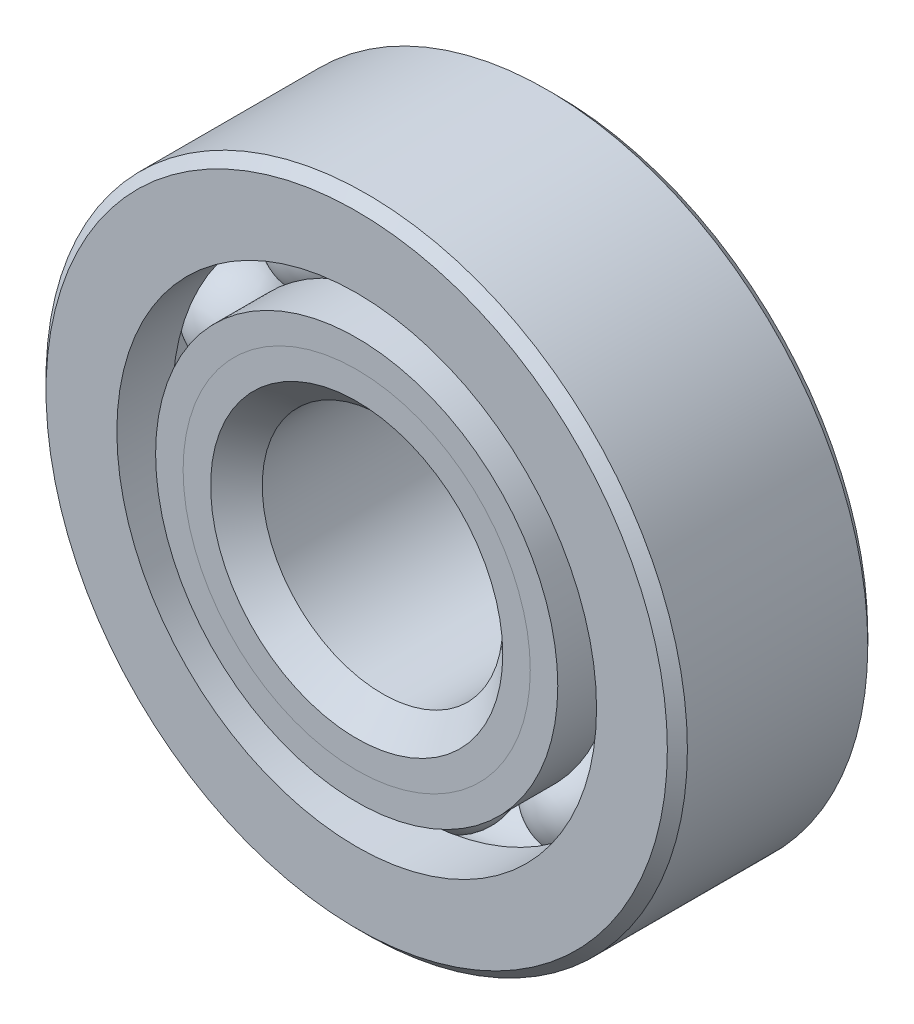
ISO-10303-21;
HEADER;
FILE_DESCRIPTION(('STEP AP214'),'2;1');
FILE_NAME('part.step','',(''),(''),'','','');
FILE_SCHEMA(('AUTOMOTIVE_DESIGN { 1 0 10303 214 1 1 1 1 }'));
ENDSEC;
DATA;
#1=APPLICATION_CONTEXT('core data for automotive mechanical design processes');
#2=APPLICATION_PROTOCOL_DEFINITION('international standard','automotive_design',2000,#1);
#3=PRODUCT_CONTEXT('',#1,'mechanical');
#4=PRODUCT('Part','Part','',(#3));
#5=PRODUCT_RELATED_PRODUCT_CATEGORY('part','',(#4));
#6=PRODUCT_DEFINITION_FORMATION('','',#4);
#7=PRODUCT_DEFINITION_CONTEXT('part definition',#1,'design');
#8=PRODUCT_DEFINITION('design','',#6,#7);
#9=PRODUCT_DEFINITION_SHAPE('','',#8);
#10=(LENGTH_UNIT() NAMED_UNIT(*) SI_UNIT(.MILLI.,.METRE.));
#11=(NAMED_UNIT(*) PLANE_ANGLE_UNIT() SI_UNIT($,.RADIAN.));
#12=(NAMED_UNIT(*) SI_UNIT($,.STERADIAN.) SOLID_ANGLE_UNIT());
#13=UNCERTAINTY_MEASURE_WITH_UNIT(LENGTH_MEASURE(1.E-05),#10,'distance_accuracy_value','');
#14=(GEOMETRIC_REPRESENTATION_CONTEXT(3) GLOBAL_UNCERTAINTY_ASSIGNED_CONTEXT((#13)) GLOBAL_UNIT_ASSIGNED_CONTEXT((#10,
#11,#12)) REPRESENTATION_CONTEXT('',''));
#15=CARTESIAN_POINT('',(0.,0.,0.));
#16=DIRECTION('',(0.,0.,1.));
#17=DIRECTION('',(1.,0.,0.));
#18=AXIS2_PLACEMENT_3D('',#15,#16,#17);
#19=CARTESIAN_POINT('',(-2.56604999203928,3.53186481606816,0.));
#20=DIRECTION('',(0.,0.,1.));
#21=DIRECTION('',(-0.587785252292462,0.809016994374955,0.));
#22=AXIS2_PLACEMENT_3D('',#19,#20,#21);
#23=SPHERICAL_SURFACE('',#22,0.961832467237323);
#24=CARTESIAN_POINT('',(-2.56604999203928,3.53186481606816,0.961832467237322));
#25=VERTEX_POINT('',#24);
#26=VERTEX_LOOP('',#25);
#27=FACE_BOUND('',#26,.T.);
#28=ADVANCED_FACE('F39',(#27),#23,.T.);
#29=CLOSED_SHELL('',(#28));
#30=MANIFOLD_SOLID_BREP('B2',#29);
#31=CARTESIAN_POINT('',(-4.15195610395101,1.34905231606818,0.));
#32=DIRECTION('',(0.,0.,1.));
#33=DIRECTION('',(-0.95105651629515,0.309016994374958,0.));
#34=AXIS2_PLACEMENT_3D('',#31,#32,#33);
#35=SPHERICAL_SURFACE('',#34,0.961832467237323);
#36=CARTESIAN_POINT('',(-4.15195610395101,1.34905231606818,0.961832467237322));
#37=VERTEX_POINT('',#36);
#38=VERTEX_LOOP('',#37);
#39=FACE_BOUND('',#38,.T.);
#40=ADVANCED_FACE('F71',(#39),#35,.T.);
#41=CLOSED_SHELL('',(#40));
#42=MANIFOLD_SOLID_BREP('B6',#41);
#43=CARTESIAN_POINT('',(-4.15195610395104,-1.34905231606809,0.));
#44=DIRECTION('',(0.,0.,1.));
#45=DIRECTION('',(-0.951056516295157,-0.309016994374938,0.));
#46=AXIS2_PLACEMENT_3D('',#43,#44,#45);
#47=SPHERICAL_SURFACE('',#46,0.961832467237323);
#48=CARTESIAN_POINT('',(-4.15195610395104,-1.34905231606809,0.961832467237322));
#49=VERTEX_POINT('',#48);
#50=VERTEX_LOOP('',#49);
#51=FACE_BOUND('',#50,.T.);
#52=ADVANCED_FACE('F103',(#51),#47,.T.);
#53=CLOSED_SHELL('',(#52));
#54=MANIFOLD_SOLID_BREP('B35',#53);
#55=CARTESIAN_POINT('',(-2.56604999203936,-3.53186481606811,0.));
#56=DIRECTION('',(0.,0.,1.));
#57=DIRECTION('',(-0.58778525229248,-0.809016994374942,0.));
#58=AXIS2_PLACEMENT_3D('',#55,#56,#57);
#59=SPHERICAL_SURFACE('',#58,0.961832467237323);
#60=CARTESIAN_POINT('',(-2.56604999203936,-3.53186481606811,0.961832467237322));
#61=VERTEX_POINT('',#60);
#62=VERTEX_LOOP('',#61);
#63=FACE_BOUND('',#62,.T.);
#64=ADVANCED_FACE('F135',(#63),#59,.T.);
#65=CLOSED_SHELL('',(#64));
#66=MANIFOLD_SOLID_BREP('B67',#65);
#67=CARTESIAN_POINT('',(0.,-4.365625,0.));
#68=DIRECTION('',(0.,0.,1.));
#69=DIRECTION('',(0.,-1.,0.));
#70=AXIS2_PLACEMENT_3D('',#67,#68,#69);
#71=SPHERICAL_SURFACE('',#70,0.961832467237323);
#72=CARTESIAN_POINT('',(0.,-4.365625,0.961832467237322));
#73=VERTEX_POINT('',#72);
#74=VERTEX_LOOP('',#73);
#75=FACE_BOUND('',#74,.T.);
#76=ADVANCED_FACE('F167',(#75),#71,.T.);
#77=CLOSED_SHELL('',(#76));
#78=MANIFOLD_SOLID_BREP('B99',#77);
#79=CARTESIAN_POINT('',(2.56604999203931,-3.53186481606814,0.));
#80=DIRECTION('',(0.,0.,1.));
#81=DIRECTION('',(0.587785252292469,-0.809016994374951,0.));
#82=AXIS2_PLACEMENT_3D('',#79,#80,#81);
#83=SPHERICAL_SURFACE('',#82,0.961832467237323);
#84=CARTESIAN_POINT('',(2.56604999203931,-3.53186481606814,0.961832467237322));
#85=VERTEX_POINT('',#84);
#86=VERTEX_LOOP('',#85);
#87=FACE_BOUND('',#86,.T.);
#88=ADVANCED_FACE('F199',(#87),#83,.T.);
#89=CLOSED_SHELL('',(#88));
#90=MANIFOLD_SOLID_BREP('B131',#89);
#91=CARTESIAN_POINT('',(4.15195610395102,-1.34905231606815,0.));
#92=DIRECTION('',(0.,0.,1.));
#93=DIRECTION('',(0.951056516295152,-0.309016994374952,0.));
#94=AXIS2_PLACEMENT_3D('',#91,#92,#93);
#95=SPHERICAL_SURFACE('',#94,0.961832467237323);
#96=CARTESIAN_POINT('',(4.15195610395102,-1.34905231606815,0.961832467237322));
#97=VERTEX_POINT('',#96);
#98=VERTEX_LOOP('',#97);
#99=FACE_BOUND('',#98,.T.);
#100=ADVANCED_FACE('F231',(#99),#95,.T.);
#101=CLOSED_SHELL('',(#100));
#102=MANIFOLD_SOLID_BREP('B163',#101);
#103=CARTESIAN_POINT('',(4.15195610395103,1.34905231606812,0.));
#104=DIRECTION('',(0.,0.,1.));
#105=DIRECTION('',(0.951056516295155,0.309016994374945,0.));
#106=AXIS2_PLACEMENT_3D('',#103,#104,#105);
#107=SPHERICAL_SURFACE('',#106,0.961832467237323);
#108=CARTESIAN_POINT('',(4.15195610395103,1.34905231606812,0.961832467237322));
#109=VERTEX_POINT('',#108);
#110=VERTEX_LOOP('',#109);
#111=FACE_BOUND('',#110,.T.);
#112=ADVANCED_FACE('F263',(#111),#107,.T.);
#113=CLOSED_SHELL('',(#112));
#114=MANIFOLD_SOLID_BREP('B195',#113);
#115=CARTESIAN_POINT('',(2.56604999203933,3.53186481606813,0.));
#116=DIRECTION('',(0.,0.,1.));
#117=DIRECTION('',(0.587785252292474,0.809016994374947,0.));
#118=AXIS2_PLACEMENT_3D('',#115,#116,#117);
#119=SPHERICAL_SURFACE('',#118,0.961832467237323);
#120=CARTESIAN_POINT('',(2.56604999203933,3.53186481606813,0.961832467237322));
#121=VERTEX_POINT('',#120);
#122=VERTEX_LOOP('',#121);
#123=FACE_BOUND('',#122,.T.);
#124=ADVANCED_FACE('F295',(#123),#119,.T.);
#125=CLOSED_SHELL('',(#124));
#126=MANIFOLD_SOLID_BREP('B227',#125);
#127=CARTESIAN_POINT('',(0.,4.365625,0.));
#128=DIRECTION('',(0.,0.,1.));
#129=DIRECTION('',(0.,1.,0.));
#130=AXIS2_PLACEMENT_3D('',#127,#128,#129);
#131=SPHERICAL_SURFACE('',#130,0.961832467237323);
#132=CARTESIAN_POINT('',(0.,4.365625,0.961832467237322));
#133=VERTEX_POINT('',#132);
#134=VERTEX_LOOP('',#133);
#135=FACE_BOUND('',#134,.T.);
#136=ADVANCED_FACE('F329',(#135),#131,.T.);
#137=CLOSED_SHELL('',(#136));
#138=MANIFOLD_SOLID_BREP('B259',#137);
#139=CARTESIAN_POINT('',(0.,3.43717752879507,1.984375));
#140=DIRECTION('',(0.,0.,-1.));
#141=DIRECTION('',(-1.,0.,0.));
#142=AXIS2_PLACEMENT_3D('',#139,#140,#141);
#143=PLANE('',#142);
#144=CARTESIAN_POINT('',(0.,0.,1.984375));
#145=DIRECTION('',(0.,0.,1.));
#146=DIRECTION('',(1.,0.,0.));
#147=AXIS2_PLACEMENT_3D('',#144,#145,#146);
#148=CIRCLE('',#147,2.89252126638134);
#149=CARTESIAN_POINT('',(2.89252126638134,0.,1.984375));
#150=VERTEX_POINT('',#149);
#151=EDGE_CURVE('E383',#150,#150,#148,.T.);
#152=ORIENTED_EDGE('',*,*,#151,.F.);
#153=EDGE_LOOP('',(#152));
#154=FACE_BOUND('',#153,.T.);
#155=CARTESIAN_POINT('',(0.,0.,1.984375));
#156=DIRECTION('',(0.,0.,1.));
#157=DIRECTION('',(1.,0.,0.));
#158=AXIS2_PLACEMENT_3D('',#155,#156,#157);
#159=CIRCLE('',#158,3.43717752879507);
#160=CARTESIAN_POINT('',(3.43717752879507,0.,1.984375));
#161=VERTEX_POINT('',#160);
#162=EDGE_CURVE('E328',#161,#161,#159,.T.);
#163=ORIENTED_EDGE('',*,*,#162,.T.);
#164=EDGE_LOOP('',(#163));
#165=FACE_BOUND('',#164,.T.);
#166=ADVANCED_FACE('F349',(#154,#165),#143,.F.);
#167=CARTESIAN_POINT('',(0.,0.,1.43971873758628));
#168=DIRECTION('',(0.,0.,1.));
#169=DIRECTION('',(1.,0.,0.));
#170=AXIS2_PLACEMENT_3D('',#167,#168,#169);
#171=CONICAL_SURFACE('',#170,2.89252126638134,0.78539816339745);
#172=ORIENTED_EDGE('',*,*,#162,.F.);
#173=EDGE_LOOP('',(#172));
#174=FACE_BOUND('',#173,.T.);
#175=CARTESIAN_POINT('',(0.,0.,1.43971873758628));
#176=DIRECTION('',(0.,0.,1.));
#177=DIRECTION('',(1.,0.,0.));
#178=AXIS2_PLACEMENT_3D('',#175,#176,#177);
#179=CIRCLE('',#178,2.89252126638134);
#180=CARTESIAN_POINT('',(2.89252126638134,0.,1.43971873758628));
#181=VERTEX_POINT('',#180);
#182=EDGE_CURVE('E355',#181,#181,#179,.T.);
#183=ORIENTED_EDGE('',*,*,#182,.T.);
#184=EDGE_LOOP('',(#183));
#185=FACE_BOUND('',#184,.T.);
#186=ADVANCED_FACE('F390',(#174,#185),#171,.T.);
#187=CARTESIAN_POINT('',(0.,0.,1.984375));
#188=DIRECTION('',(0.,0.,1.));
#189=DIRECTION('',(1.,0.,0.));
#190=AXIS2_PLACEMENT_3D('',#187,#188,#189);
#191=CYLINDRICAL_SURFACE('',#190,2.89252126638134);
#192=ORIENTED_EDGE('',*,*,#182,.F.);
#193=EDGE_LOOP('',(#192));
#194=FACE_BOUND('',#193,.T.);
#195=CARTESIAN_POINT('',(0.,0.,0.));
#196=DIRECTION('',(0.,0.,1.));
#197=DIRECTION('',(1.,0.,0.));
#198=AXIS2_PLACEMENT_3D('',#195,#196,#197);
#199=CIRCLE('',#198,2.89252126638134);
#200=CARTESIAN_POINT('',(2.89252126638134,0.,0.));
#201=VERTEX_POINT('',#200);
#202=EDGE_CURVE('E359',#201,#201,#199,.T.);
#203=ORIENTED_EDGE('',*,*,#202,.T.);
#204=EDGE_LOOP('',(#203));
#205=FACE_BOUND('',#204,.T.);
#206=ADVANCED_FACE('F394',(#194,#205),#191,.T.);
#207=CARTESIAN_POINT('',(0.,2.89252126638134,0.));
#208=DIRECTION('',(0.,0.,-1.));
#209=DIRECTION('',(-1.,0.,0.));
#210=AXIS2_PLACEMENT_3D('',#207,#208,#209);
#211=PLANE('',#210);
#212=ORIENTED_EDGE('',*,*,#202,.F.);
#213=EDGE_LOOP('',(#212));
#214=FACE_BOUND('',#213,.T.);
#215=CARTESIAN_POINT('',(0.,0.,0.));
#216=DIRECTION('',(0.,0.,1.));
#217=DIRECTION('',(1.,0.,0.));
#218=AXIS2_PLACEMENT_3D('',#215,#216,#217);
#219=CIRCLE('',#218,3.40379253276268);
#220=CARTESIAN_POINT('',(3.40379253276268,0.,0.));
#221=VERTEX_POINT('',#220);
#222=EDGE_CURVE('E363',#221,#221,#219,.T.);
#223=ORIENTED_EDGE('',*,*,#222,.T.);
#224=EDGE_LOOP('',(#223));
#225=FACE_BOUND('',#224,.T.);
#226=ADVANCED_FACE('F399',(#214,#225),#211,.F.);
#227=CARTESIAN_POINT('',(0.,0.,0.));
#228=DIRECTION('',(0.,0.,1.));
#229=DIRECTION('',(1.,0.,0.));
#230=AXIS2_PLACEMENT_3D('',#227,#228,#229);
#231=TOROIDAL_SURFACE('',#230,4.365625,0.961832467237322);
#232=ORIENTED_EDGE('',*,*,#222,.F.);
#233=EDGE_LOOP('',(#232));
#234=FACE_BOUND('',#233,.T.);
#235=CARTESIAN_POINT('',(0.,0.,-0.881944444444445));
#236=DIRECTION('',(0.,0.,1.));
#237=DIRECTION('',(1.,0.,0.));
#238=AXIS2_PLACEMENT_3D('',#235,#236,#237);
#239=CIRCLE('',#238,3.98183379120879);
#240=CARTESIAN_POINT('',(3.98183379120879,0.,-0.881944444444445));
#241=VERTEX_POINT('',#240);
#242=EDGE_CURVE('E368',#241,#241,#239,.T.);
#243=ORIENTED_EDGE('',*,*,#242,.T.);
#244=EDGE_LOOP('',(#243));
#245=FACE_BOUND('',#244,.T.);
#246=ADVANCED_FACE('F405',(#234,#245),#231,.F.);
#247=CARTESIAN_POINT('',(0.,0.,1.984375));
#248=DIRECTION('',(0.,0.,1.));
#249=DIRECTION('',(1.,0.,0.));
#250=AXIS2_PLACEMENT_3D('',#247,#248,#249);
#251=CYLINDRICAL_SURFACE('',#250,3.98183379120879);
#252=ORIENTED_EDGE('',*,*,#242,.F.);
#253=EDGE_LOOP('',(#252));
#254=FACE_BOUND('',#253,.T.);
#255=CARTESIAN_POINT('',(0.,0.,-1.984375));
#256=DIRECTION('',(0.,0.,1.));
#257=DIRECTION('',(1.,0.,0.));
#258=AXIS2_PLACEMENT_3D('',#255,#256,#257);
#259=CIRCLE('',#258,3.98183379120879);
#260=CARTESIAN_POINT('',(3.98183379120879,0.,-1.984375));
#261=VERTEX_POINT('',#260);
#262=EDGE_CURVE('E371',#261,#261,#259,.T.);
#263=ORIENTED_EDGE('',*,*,#262,.T.);
#264=EDGE_LOOP('',(#263));
#265=FACE_BOUND('',#264,.T.);
#266=ADVANCED_FACE('F409',(#254,#265),#251,.T.);
#267=CARTESIAN_POINT('',(0.,2.5796875,-1.984375));
#268=DIRECTION('',(0.,0.,1.));
#269=DIRECTION('',(1.,0.,0.));
#270=AXIS2_PLACEMENT_3D('',#267,#268,#269);
#271=PLANE('',#270);
#272=ORIENTED_EDGE('',*,*,#262,.F.);
#273=EDGE_LOOP('',(#272));
#274=FACE_BOUND('',#273,.T.);
#275=CARTESIAN_POINT('',(0.,0.,-1.984375));
#276=DIRECTION('',(0.,0.,1.));
#277=DIRECTION('',(1.,0.,0.));
#278=AXIS2_PLACEMENT_3D('',#275,#276,#277);
#279=CIRCLE('',#278,2.5796875);
#280=CARTESIAN_POINT('',(2.5796875,0.,-1.984375));
#281=VERTEX_POINT('',#280);
#282=EDGE_CURVE('E374',#281,#281,#279,.T.);
#283=ORIENTED_EDGE('',*,*,#282,.T.);
#284=EDGE_LOOP('',(#283));
#285=FACE_BOUND('',#284,.T.);
#286=ADVANCED_FACE('F413',(#274,#285),#271,.F.);
#287=CARTESIAN_POINT('',(0.,0.,-1.7859375));
#288=DIRECTION('',(0.,0.,-1.));
#289=DIRECTION('',(-1.,0.,0.));
#290=AXIS2_PLACEMENT_3D('',#287,#288,#289);
#291=CONICAL_SURFACE('',#290,2.38125,0.785398163397448);
#292=ORIENTED_EDGE('',*,*,#282,.F.);
#293=EDGE_LOOP('',(#292));
#294=FACE_BOUND('',#293,.T.);
#295=CARTESIAN_POINT('',(0.,0.,-1.7859375));
#296=DIRECTION('',(0.,0.,1.));
#297=DIRECTION('',(1.,0.,0.));
#298=AXIS2_PLACEMENT_3D('',#295,#296,#297);
#299=CIRCLE('',#298,2.38125);
#300=CARTESIAN_POINT('',(2.38125,0.,-1.7859375));
#301=VERTEX_POINT('',#300);
#302=EDGE_CURVE('E377',#301,#301,#299,.T.);
#303=ORIENTED_EDGE('',*,*,#302,.T.);
#304=EDGE_LOOP('',(#303));
#305=FACE_BOUND('',#304,.T.);
#306=ADVANCED_FACE('F417',(#294,#305),#291,.F.);
#307=CARTESIAN_POINT('',(0.,0.,1.984375));
#308=DIRECTION('',(0.,0.,1.));
#309=DIRECTION('',(1.,0.,0.));
#310=AXIS2_PLACEMENT_3D('',#307,#308,#309);
#311=CYLINDRICAL_SURFACE('',#310,2.38125);
#312=ORIENTED_EDGE('',*,*,#302,.F.);
#313=EDGE_LOOP('',(#312));
#314=FACE_BOUND('',#313,.T.);
#315=CARTESIAN_POINT('',(0.,0.,1.47310373361866));
#316=DIRECTION('',(0.,0.,1.));
#317=DIRECTION('',(1.,0.,0.));
#318=AXIS2_PLACEMENT_3D('',#315,#316,#317);
#319=CIRCLE('',#318,2.38125);
#320=CARTESIAN_POINT('',(2.38125,0.,1.47310373361866));
#321=VERTEX_POINT('',#320);
#322=EDGE_CURVE('E380',#321,#321,#319,.T.);
#323=ORIENTED_EDGE('',*,*,#322,.T.);
#324=EDGE_LOOP('',(#323));
#325=FACE_BOUND('',#324,.T.);
#326=ADVANCED_FACE('F421',(#314,#325),#311,.F.);
#327=CARTESIAN_POINT('',(0.,0.,1.984375));
#328=DIRECTION('',(0.,0.,1.));
#329=DIRECTION('',(1.,0.,0.));
#330=AXIS2_PLACEMENT_3D('',#327,#328,#329);
#331=CONICAL_SURFACE('',#330,2.89252126638134,0.78539816339745);
#332=ORIENTED_EDGE('',*,*,#322,.F.);
#333=EDGE_LOOP('',(#332));
#334=FACE_BOUND('',#333,.T.);
#335=ORIENTED_EDGE('',*,*,#151,.T.);
#336=EDGE_LOOP('',(#335));
#337=FACE_BOUND('',#336,.T.);
#338=ADVANCED_FACE('F387',(#334,#337),#331,.F.);
#339=CLOSED_SHELL('',(#166,#186,#206,#226,#246,#266,#286,#306,#326,#338));
#340=MANIFOLD_SOLID_BREP('B291',#339);
#341=CARTESIAN_POINT('',(0.,3.98183379120879,1.984375));
#342=DIRECTION('',(0.,0.,-1.));
#343=DIRECTION('',(-1.,0.,0.));
#344=AXIS2_PLACEMENT_3D('',#341,#342,#343);
#345=PLANE('',#344);
#346=CARTESIAN_POINT('',(0.,0.,1.984375));
#347=DIRECTION('',(0.,0.,1.));
#348=DIRECTION('',(1.,0.,0.));
#349=AXIS2_PLACEMENT_3D('',#346,#347,#348);
#350=CIRCLE('',#349,3.43717752879507);
#351=CARTESIAN_POINT('',(3.43717752879507,0.,1.984375));
#352=VERTEX_POINT('',#351);
#353=EDGE_CURVE('E348',#352,#352,#350,.T.);
#354=ORIENTED_EDGE('',*,*,#353,.F.);
#355=EDGE_LOOP('',(#354));
#356=FACE_BOUND('',#355,.T.);
#357=CARTESIAN_POINT('',(0.,0.,1.984375));
#358=DIRECTION('',(0.,0.,1.));
#359=DIRECTION('',(1.,0.,0.));
#360=AXIS2_PLACEMENT_3D('',#357,#358,#359);
#361=CIRCLE('',#360,3.98183379120879);
#362=CARTESIAN_POINT('',(3.98183379120879,0.,1.984375));
#363=VERTEX_POINT('',#362);
#364=EDGE_CURVE('E529',#363,#363,#361,.T.);
#365=ORIENTED_EDGE('',*,*,#364,.T.);
#366=EDGE_LOOP('',(#365));
#367=FACE_BOUND('',#366,.T.);
#368=ADVANCED_FACE('F507',(#356,#367),#345,.F.);
#369=CARTESIAN_POINT('',(0.,0.,1.984375));
#370=DIRECTION('',(0.,0.,1.));
#371=DIRECTION('',(1.,0.,0.));
#372=AXIS2_PLACEMENT_3D('',#369,#370,#371);
#373=CONICAL_SURFACE('',#372,3.43717752879507,0.78539816339745);
#374=CARTESIAN_POINT('',(0.,0.,1.43971873758628));
#375=DIRECTION('',(0.,0.,1.));
#376=DIRECTION('',(1.,0.,0.));
#377=AXIS2_PLACEMENT_3D('',#374,#375,#376);
#378=CIRCLE('',#377,2.89252126638134);
#379=CARTESIAN_POINT('',(2.89252126638134,0.,1.43971873758628));
#380=VERTEX_POINT('',#379);
#381=EDGE_CURVE('E513',#380,#380,#378,.T.);
#382=ORIENTED_EDGE('',*,*,#381,.F.);
#383=EDGE_LOOP('',(#382));
#384=FACE_BOUND('',#383,.T.);
#385=ORIENTED_EDGE('',*,*,#353,.T.);
#386=EDGE_LOOP('',(#385));
#387=FACE_BOUND('',#386,.T.);
#388=ADVANCED_FACE('F554',(#384,#387),#373,.F.);
#389=CARTESIAN_POINT('',(0.,0.,1.984375));
#390=DIRECTION('',(0.,0.,1.));
#391=DIRECTION('',(1.,0.,0.));
#392=AXIS2_PLACEMENT_3D('',#389,#390,#391);
#393=CYLINDRICAL_SURFACE('',#392,2.89252126638134);
#394=CARTESIAN_POINT('',(0.,0.,0.));
#395=DIRECTION('',(0.,0.,1.));
#396=DIRECTION('',(1.,0.,0.));
#397=AXIS2_PLACEMENT_3D('',#394,#395,#396);
#398=CIRCLE('',#397,2.89252126638134);
#399=CARTESIAN_POINT('',(2.89252126638134,0.,0.));
#400=VERTEX_POINT('',#399);
#401=EDGE_CURVE('E517',#400,#400,#398,.T.);
#402=ORIENTED_EDGE('',*,*,#401,.F.);
#403=EDGE_LOOP('',(#402));
#404=FACE_BOUND('',#403,.T.);
#405=ORIENTED_EDGE('',*,*,#381,.T.);
#406=EDGE_LOOP('',(#405));
#407=FACE_BOUND('',#406,.T.);
#408=ADVANCED_FACE('F549',(#404,#407),#393,.F.);
#409=CARTESIAN_POINT('',(0.,2.89252126638134,0.));
#410=DIRECTION('',(0.,0.,1.));
#411=DIRECTION('',(1.,0.,0.));
#412=AXIS2_PLACEMENT_3D('',#409,#410,#411);
#413=PLANE('',#412);
#414=CARTESIAN_POINT('',(0.,0.,0.));
#415=DIRECTION('',(0.,0.,1.));
#416=DIRECTION('',(1.,0.,0.));
#417=AXIS2_PLACEMENT_3D('',#414,#415,#416);
#418=CIRCLE('',#417,3.40379253276268);
#419=CARTESIAN_POINT('',(3.40379253276268,0.,0.));
#420=VERTEX_POINT('',#419);
#421=EDGE_CURVE('E521',#420,#420,#418,.T.);
#422=ORIENTED_EDGE('',*,*,#421,.F.);
#423=EDGE_LOOP('',(#422));
#424=FACE_BOUND('',#423,.T.);
#425=ORIENTED_EDGE('',*,*,#401,.T.);
#426=EDGE_LOOP('',(#425));
#427=FACE_BOUND('',#426,.T.);
#428=ADVANCED_FACE('F543',(#424,#427),#413,.F.);
#429=CARTESIAN_POINT('',(0.,0.,0.));
#430=DIRECTION('',(0.,0.,1.));
#431=DIRECTION('',(1.,0.,0.));
#432=AXIS2_PLACEMENT_3D('',#429,#430,#431);
#433=TOROIDAL_SURFACE('',#432,4.365625,0.961832467237323);
#434=CARTESIAN_POINT('',(0.,0.,0.881944444444443));
#435=DIRECTION('',(0.,0.,1.));
#436=DIRECTION('',(1.,0.,0.));
#437=AXIS2_PLACEMENT_3D('',#434,#435,#436);
#438=CIRCLE('',#437,3.98183379120879);
#439=CARTESIAN_POINT('',(3.98183379120879,0.,0.881944444444443));
#440=VERTEX_POINT('',#439);
#441=EDGE_CURVE('E526',#440,#440,#438,.T.);
#442=ORIENTED_EDGE('',*,*,#441,.F.);
#443=EDGE_LOOP('',(#442));
#444=FACE_BOUND('',#443,.T.);
#445=ORIENTED_EDGE('',*,*,#421,.T.);
#446=EDGE_LOOP('',(#445));
#447=FACE_BOUND('',#446,.T.);
#448=ADVANCED_FACE('F537',(#444,#447),#433,.F.);
#449=CARTESIAN_POINT('',(0.,0.,1.984375));
#450=DIRECTION('',(0.,0.,1.));
#451=DIRECTION('',(1.,0.,0.));
#452=AXIS2_PLACEMENT_3D('',#449,#450,#451);
#453=CYLINDRICAL_SURFACE('',#452,3.98183379120879);
#454=ORIENTED_EDGE('',*,*,#364,.F.);
#455=EDGE_LOOP('',(#454));
#456=FACE_BOUND('',#455,.T.);
#457=ORIENTED_EDGE('',*,*,#441,.T.);
#458=EDGE_LOOP('',(#457));
#459=FACE_BOUND('',#458,.T.);
#460=ADVANCED_FACE('F534',(#456,#459),#453,.T.);
#461=CLOSED_SHELL('',(#368,#388,#408,#428,#448,#460));
#462=MANIFOLD_SOLID_BREP('B323',#461);
#463=CARTESIAN_POINT('',(0.,0.,1.7859375));
#464=DIRECTION('',(0.,0.,-1.));
#465=DIRECTION('',(-1.,0.,0.));
#466=AXIS2_PLACEMENT_3D('',#463,#464,#465);
#467=CONICAL_SURFACE('',#466,6.35,0.785398163397449);
#468=CARTESIAN_POINT('',(0.,0.,1.984375));
#469=DIRECTION('',(0.,0.,1.));
#470=DIRECTION('',(1.,0.,0.));
#471=AXIS2_PLACEMENT_3D('',#468,#469,#470);
#472=CIRCLE('',#471,6.1515625);
#473=CARTESIAN_POINT('',(6.1515625,0.,1.984375));
#474=VERTEX_POINT('',#473);
#475=EDGE_CURVE('E626',#474,#474,#472,.T.);
#476=ORIENTED_EDGE('',*,*,#475,.F.);
#477=EDGE_LOOP('',(#476));
#478=FACE_BOUND('',#477,.T.);
#479=CARTESIAN_POINT('',(0.,0.,1.7859375));
#480=DIRECTION('',(0.,0.,1.));
#481=DIRECTION('',(1.,0.,0.));
#482=AXIS2_PLACEMENT_3D('',#479,#480,#481);
#483=CIRCLE('',#482,6.35);
#484=CARTESIAN_POINT('',(6.35,0.,1.7859375));
#485=VERTEX_POINT('',#484);
#486=EDGE_CURVE('E506',#485,#485,#483,.T.);
#487=ORIENTED_EDGE('',*,*,#486,.T.);
#488=EDGE_LOOP('',(#487));
#489=FACE_BOUND('',#488,.T.);
#490=ADVANCED_FACE('F598',(#478,#489),#467,.T.);
#491=CARTESIAN_POINT('',(0.,0.,1.984375));
#492=DIRECTION('',(0.,0.,1.));
#493=DIRECTION('',(1.,0.,0.));
#494=AXIS2_PLACEMENT_3D('',#491,#492,#493);
#495=CYLINDRICAL_SURFACE('',#494,6.35);
#496=ORIENTED_EDGE('',*,*,#486,.F.);
#497=EDGE_LOOP('',(#496));
#498=FACE_BOUND('',#497,.T.);
#499=CARTESIAN_POINT('',(0.,0.,-1.7859375));
#500=DIRECTION('',(0.,0.,1.));
#501=DIRECTION('',(1.,0.,0.));
#502=AXIS2_PLACEMENT_3D('',#499,#500,#501);
#503=CIRCLE('',#502,6.35);
#504=CARTESIAN_POINT('',(6.35,0.,-1.7859375));
#505=VERTEX_POINT('',#504);
#506=EDGE_CURVE('E604',#505,#505,#503,.T.);
#507=ORIENTED_EDGE('',*,*,#506,.T.);
#508=EDGE_LOOP('',(#507));
#509=FACE_BOUND('',#508,.T.);
#510=ADVANCED_FACE('F633',(#498,#509),#495,.T.);
#511=CARTESIAN_POINT('',(0.,0.,-1.984375));
#512=DIRECTION('',(0.,0.,1.));
#513=DIRECTION('',(1.,0.,0.));
#514=AXIS2_PLACEMENT_3D('',#511,#512,#513);
#515=CONICAL_SURFACE('',#514,6.1515625,0.78539816339745);
#516=ORIENTED_EDGE('',*,*,#506,.F.);
#517=EDGE_LOOP('',(#516));
#518=FACE_BOUND('',#517,.T.);
#519=CARTESIAN_POINT('',(0.,0.,-1.984375));
#520=DIRECTION('',(0.,0.,1.));
#521=DIRECTION('',(1.,0.,0.));
#522=AXIS2_PLACEMENT_3D('',#519,#520,#521);
#523=CIRCLE('',#522,6.1515625);
#524=CARTESIAN_POINT('',(6.1515625,0.,-1.984375));
#525=VERTEX_POINT('',#524);
#526=EDGE_CURVE('E608',#525,#525,#523,.T.);
#527=ORIENTED_EDGE('',*,*,#526,.T.);
#528=EDGE_LOOP('',(#527));
#529=FACE_BOUND('',#528,.T.);
#530=ADVANCED_FACE('F637',(#518,#529),#515,.T.);
#531=CARTESIAN_POINT('',(0.,6.1515625,-1.984375));
#532=DIRECTION('',(0.,0.,1.));
#533=DIRECTION('',(1.,0.,0.));
#534=AXIS2_PLACEMENT_3D('',#531,#532,#533);
#535=PLANE('',#534);
#536=ORIENTED_EDGE('',*,*,#526,.F.);
#537=EDGE_LOOP('',(#536));
#538=FACE_BOUND('',#537,.T.);
#539=CARTESIAN_POINT('',(0.,0.,-1.984375));
#540=DIRECTION('',(0.,0.,1.));
#541=DIRECTION('',(1.,0.,0.));
#542=AXIS2_PLACEMENT_3D('',#539,#540,#541);
#543=CIRCLE('',#542,4.74941620879121);
#544=CARTESIAN_POINT('',(4.74941620879121,0.,-1.984375));
#545=VERTEX_POINT('',#544);
#546=EDGE_CURVE('E612',#545,#545,#543,.T.);
#547=ORIENTED_EDGE('',*,*,#546,.T.);
#548=EDGE_LOOP('',(#547));
#549=FACE_BOUND('',#548,.T.);
#550=ADVANCED_FACE('F642',(#538,#549),#535,.F.);
#551=CARTESIAN_POINT('',(0.,0.,1.984375));
#552=DIRECTION('',(0.,0.,1.));
#553=DIRECTION('',(1.,0.,0.));
#554=AXIS2_PLACEMENT_3D('',#551,#552,#553);
#555=CYLINDRICAL_SURFACE('',#554,4.74941620879121);
#556=ORIENTED_EDGE('',*,*,#546,.F.);
#557=EDGE_LOOP('',(#556));
#558=FACE_BOUND('',#557,.T.);
#559=CARTESIAN_POINT('',(0.,0.,-0.881944444444445));
#560=DIRECTION('',(0.,0.,1.));
#561=DIRECTION('',(1.,0.,0.));
#562=AXIS2_PLACEMENT_3D('',#559,#560,#561);
#563=CIRCLE('',#562,4.74941620879121);
#564=CARTESIAN_POINT('',(4.74941620879121,0.,-0.881944444444445));
#565=VERTEX_POINT('',#564);
#566=EDGE_CURVE('E617',#565,#565,#563,.T.);
#567=ORIENTED_EDGE('',*,*,#566,.T.);
#568=EDGE_LOOP('',(#567));
#569=FACE_BOUND('',#568,.T.);
#570=ADVANCED_FACE('F648',(#558,#569),#555,.F.);
#571=CARTESIAN_POINT('',(0.,0.,0.));
#572=DIRECTION('',(0.,0.,1.));
#573=DIRECTION('',(1.,0.,0.));
#574=AXIS2_PLACEMENT_3D('',#571,#572,#573);
#575=TOROIDAL_SURFACE('',#574,4.365625,0.961832467237323);
#576=ORIENTED_EDGE('',*,*,#566,.F.);
#577=EDGE_LOOP('',(#576));
#578=FACE_BOUND('',#577,.T.);
#579=CARTESIAN_POINT('',(0.,0.,0.881944444444444));
#580=DIRECTION('',(0.,0.,1.));
#581=DIRECTION('',(1.,0.,0.));
#582=AXIS2_PLACEMENT_3D('',#579,#580,#581);
#583=CIRCLE('',#582,4.74941620879121);
#584=CARTESIAN_POINT('',(4.74941620879121,0.,0.881944444444444));
#585=VERTEX_POINT('',#584);
#586=EDGE_CURVE('E620',#585,#585,#583,.T.);
#587=ORIENTED_EDGE('',*,*,#586,.T.);
#588=EDGE_LOOP('',(#587));
#589=FACE_BOUND('',#588,.T.);
#590=ADVANCED_FACE('F652',(#578,#589),#575,.F.);
#591=CARTESIAN_POINT('',(0.,0.,1.984375));
#592=DIRECTION('',(0.,0.,1.));
#593=DIRECTION('',(1.,0.,0.));
#594=AXIS2_PLACEMENT_3D('',#591,#592,#593);
#595=CYLINDRICAL_SURFACE('',#594,4.74941620879121);
#596=ORIENTED_EDGE('',*,*,#586,.F.);
#597=EDGE_LOOP('',(#596));
#598=FACE_BOUND('',#597,.T.);
#599=CARTESIAN_POINT('',(0.,0.,1.984375));
#600=DIRECTION('',(0.,0.,1.));
#601=DIRECTION('',(1.,0.,0.));
#602=AXIS2_PLACEMENT_3D('',#599,#600,#601);
#603=CIRCLE('',#602,4.74941620879121);
#604=CARTESIAN_POINT('',(4.74941620879121,0.,1.984375));
#605=VERTEX_POINT('',#604);
#606=EDGE_CURVE('E623',#605,#605,#603,.T.);
#607=ORIENTED_EDGE('',*,*,#606,.T.);
#608=EDGE_LOOP('',(#607));
#609=FACE_BOUND('',#608,.T.);
#610=ADVANCED_FACE('F656',(#598,#609),#595,.F.);
#611=CARTESIAN_POINT('',(0.,6.1515625,1.984375));
#612=DIRECTION('',(0.,0.,-1.));
#613=DIRECTION('',(-1.,0.,0.));
#614=AXIS2_PLACEMENT_3D('',#611,#612,#613);
#615=PLANE('',#614);
#616=ORIENTED_EDGE('',*,*,#606,.F.);
#617=EDGE_LOOP('',(#616));
#618=FACE_BOUND('',#617,.T.);
#619=ORIENTED_EDGE('',*,*,#475,.T.);
#620=EDGE_LOOP('',(#619));
#621=FACE_BOUND('',#620,.T.);
#622=ADVANCED_FACE('F630',(#618,#621),#615,.F.);
#623=CLOSED_SHELL('',(#490,#510,#530,#550,#570,#590,#610,#622));
#624=MANIFOLD_SOLID_BREP('B343',#623);
#625=ADVANCED_BREP_SHAPE_REPRESENTATION('',(#18,#30,#42,#54,#66,#78,#90,#102,#114,#126,#138,
#340,#462,#624),#14);
#626=SHAPE_DEFINITION_REPRESENTATION(#9,#625);
ENDSEC;
END-ISO-10303-21;
